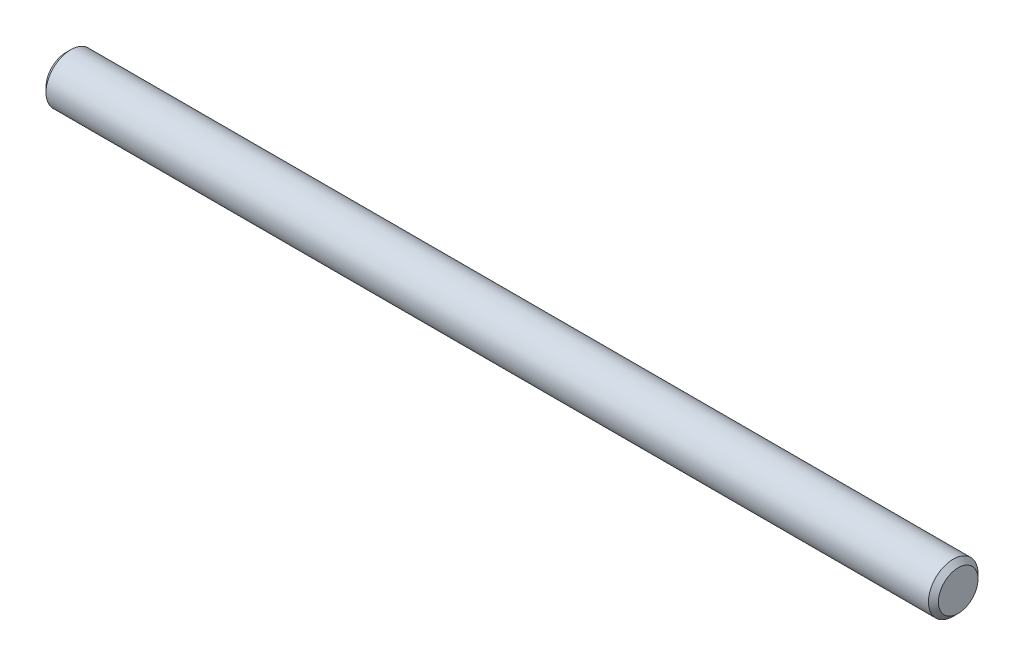
ISO-10303-21;
HEADER;
FILE_DESCRIPTION(('STEP AP214'),'2;1');
FILE_NAME('part.step','',(''),(''),'','','');
FILE_SCHEMA(('AUTOMOTIVE_DESIGN { 1 0 10303 214 1 1 1 1 }'));
ENDSEC;
DATA;
#1=APPLICATION_CONTEXT('core data for automotive mechanical design processes');
#2=APPLICATION_PROTOCOL_DEFINITION('international standard','automotive_design',2000,#1);
#3=PRODUCT_CONTEXT('',#1,'mechanical');
#4=PRODUCT('Part','Part','',(#3));
#5=PRODUCT_RELATED_PRODUCT_CATEGORY('part','',(#4));
#6=PRODUCT_DEFINITION_FORMATION('','',#4);
#7=PRODUCT_DEFINITION_CONTEXT('part definition',#1,'design');
#8=PRODUCT_DEFINITION('design','',#6,#7);
#9=PRODUCT_DEFINITION_SHAPE('','',#8);
#10=(LENGTH_UNIT() NAMED_UNIT(*) SI_UNIT(.MILLI.,.METRE.));
#11=(NAMED_UNIT(*) PLANE_ANGLE_UNIT() SI_UNIT($,.RADIAN.));
#12=(NAMED_UNIT(*) SI_UNIT($,.STERADIAN.) SOLID_ANGLE_UNIT());
#13=UNCERTAINTY_MEASURE_WITH_UNIT(LENGTH_MEASURE(1.E-05),#10,'distance_accuracy_value','');
#14=(GEOMETRIC_REPRESENTATION_CONTEXT(3) GLOBAL_UNCERTAINTY_ASSIGNED_CONTEXT((#13)) GLOBAL_UNIT_ASSIGNED_CONTEXT((#10,
#11,#12)) REPRESENTATION_CONTEXT('',''));
#15=CARTESIAN_POINT('',(0.,0.,0.));
#16=DIRECTION('',(0.,0.,1.));
#17=DIRECTION('',(1.,0.,0.));
#18=AXIS2_PLACEMENT_3D('',#15,#16,#17);
#19=CARTESIAN_POINT('',(-18.,0.,0.));
#20=DIRECTION('',(1.,0.,0.));
#21=DIRECTION('',(0.,1.,0.));
#22=AXIS2_PLACEMENT_3D('',#19,#20,#21);
#23=PLANE('',#22);
#24=CARTESIAN_POINT('',(-18.,0.,0.));
#25=DIRECTION('',(1.,0.,0.));
#26=DIRECTION('',(0.,1.,0.));
#27=AXIS2_PLACEMENT_3D('',#24,#25,#26);
#28=CIRCLE('',#27,0.800000000000005);
#29=CARTESIAN_POINT('',(-18.,0.800000000000005,0.));
#30=VERTEX_POINT('',#29);
#31=EDGE_CURVE('E49',#30,#30,#28,.F.);
#32=ORIENTED_EDGE('',*,*,#31,.T.);
#33=EDGE_LOOP('',(#32));
#34=FACE_BOUND('',#33,.T.);
#35=ADVANCED_FACE('F34',(#34),#23,.F.);
#36=CARTESIAN_POINT('',(-18.,0.,0.));
#37=DIRECTION('',(-1.,0.,0.));
#38=DIRECTION('',(0.,-1.,0.));
#39=AXIS2_PLACEMENT_3D('',#36,#37,#38);
#40=CYLINDRICAL_SURFACE('',#39,0.999999999999997);
#41=CARTESIAN_POINT('',(-17.8,0.,0.));
#42=DIRECTION('',(1.,0.,0.));
#43=DIRECTION('',(0.,1.,0.));
#44=AXIS2_PLACEMENT_3D('',#41,#42,#43);
#45=CIRCLE('',#44,0.999999999999997);
#46=CARTESIAN_POINT('',(-17.8,0.999999999999997,0.));
#47=VERTEX_POINT('',#46);
#48=EDGE_CURVE('E41',#47,#47,#45,.T.);
#49=ORIENTED_EDGE('',*,*,#48,.T.);
#50=EDGE_LOOP('',(#49));
#51=FACE_BOUND('',#50,.T.);
#52=CARTESIAN_POINT('',(17.8,0.,0.));
#53=DIRECTION('',(-1.,0.,0.));
#54=DIRECTION('',(0.,-1.,0.));
#55=AXIS2_PLACEMENT_3D('',#52,#53,#54);
#56=CIRCLE('',#55,0.999999999999997);
#57=CARTESIAN_POINT('',(17.8,-0.99999999999999,0.));
#58=VERTEX_POINT('',#57);
#59=EDGE_CURVE('E45',#58,#58,#56,.T.);
#60=ORIENTED_EDGE('',*,*,#59,.T.);
#61=EDGE_LOOP('',(#60));
#62=FACE_BOUND('',#61,.T.);
#63=ADVANCED_FACE('F65',(#51,#62),#40,.T.);
#64=CARTESIAN_POINT('',(18.,0.,0.));
#65=DIRECTION('',(-1.,0.,0.));
#66=DIRECTION('',(0.,-1.,0.));
#67=AXIS2_PLACEMENT_3D('',#64,#65,#66);
#68=PLANE('',#67);
#69=CARTESIAN_POINT('',(18.,0.,0.));
#70=DIRECTION('',(-1.,0.,0.));
#71=DIRECTION('',(0.,-1.,0.));
#72=AXIS2_PLACEMENT_3D('',#69,#70,#71);
#73=CIRCLE('',#72,0.800000000000002);
#74=CARTESIAN_POINT('',(18.,-0.799999999999995,0.));
#75=VERTEX_POINT('',#74);
#76=EDGE_CURVE('E10',#75,#75,#73,.F.);
#77=ORIENTED_EDGE('',*,*,#76,.T.);
#78=EDGE_LOOP('',(#77));
#79=FACE_BOUND('',#78,.T.);
#80=ADVANCED_FACE('F58',(#79),#68,.F.);
#81=CARTESIAN_POINT('',(-18.,0.,0.));
#82=DIRECTION('',(1.,0.,0.));
#83=DIRECTION('',(0.,1.,0.));
#84=AXIS2_PLACEMENT_3D('',#81,#82,#83);
#85=CONICAL_SURFACE('',#84,0.800000000000005,0.785398163397447);
#86=ORIENTED_EDGE('',*,*,#48,.F.);
#87=EDGE_LOOP('',(#86));
#88=FACE_BOUND('',#87,.T.);
#89=ORIENTED_EDGE('',*,*,#31,.F.);
#90=EDGE_LOOP('',(#89));
#91=FACE_BOUND('',#90,.T.);
#92=ADVANCED_FACE('F56',(#88,#91),#85,.T.);
#93=CARTESIAN_POINT('',(17.8,0.,0.));
#94=DIRECTION('',(-1.,0.,0.));
#95=DIRECTION('',(0.,-1.,0.));
#96=AXIS2_PLACEMENT_3D('',#93,#94,#95);
#97=CONICAL_SURFACE('',#96,0.999999999999997,0.785398163397439);
#98=ORIENTED_EDGE('',*,*,#76,.F.);
#99=EDGE_LOOP('',(#98));
#100=FACE_BOUND('',#99,.T.);
#101=ORIENTED_EDGE('',*,*,#59,.F.);
#102=EDGE_LOOP('',(#101));
#103=FACE_BOUND('',#102,.T.);
#104=ADVANCED_FACE('F36',(#100,#103),#97,.T.);
#105=CLOSED_SHELL('',(#35,#63,#80,#92,#104));
#106=MANIFOLD_SOLID_BREP('B2',#105);
#107=ADVANCED_BREP_SHAPE_REPRESENTATION('',(#18,#106),#14);
#108=SHAPE_DEFINITION_REPRESENTATION(#9,#107);
ENDSEC;
END-ISO-10303-21;
